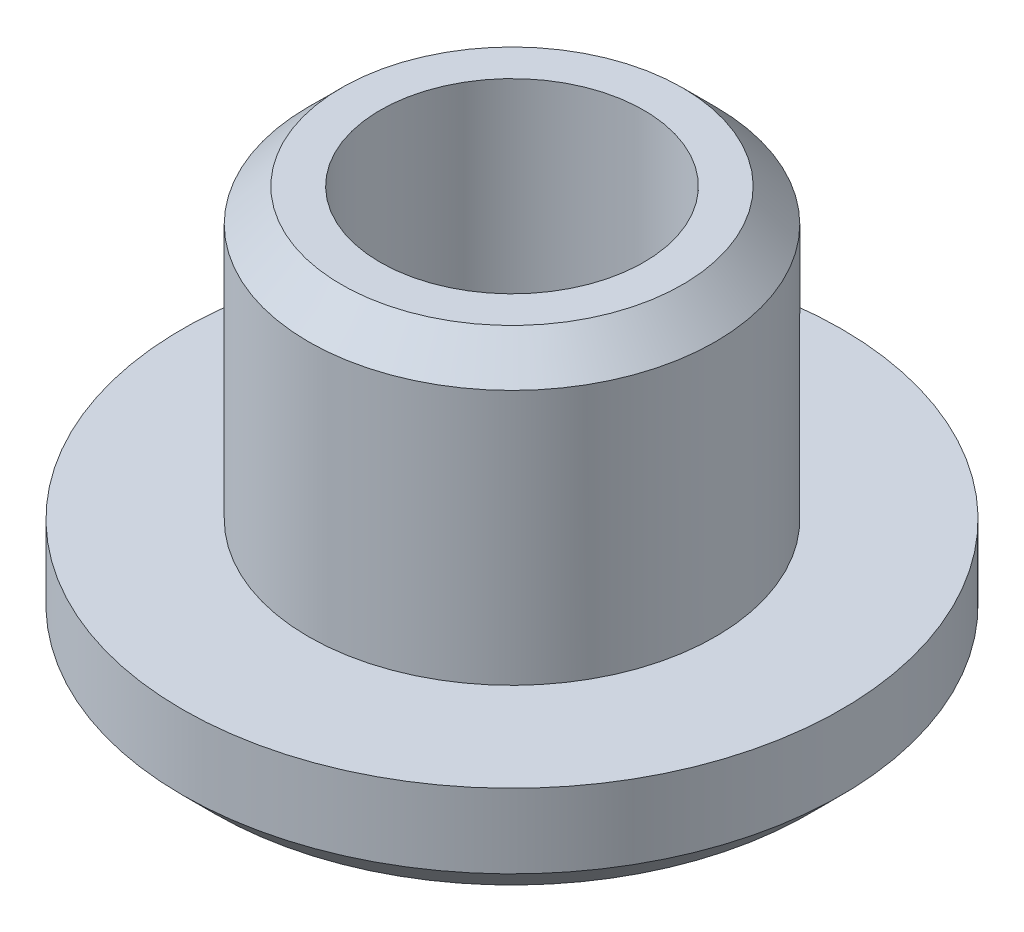
ISO-10303-21;
HEADER;
FILE_DESCRIPTION(('STEP AP214'),'2;1');
FILE_NAME('part.step','',(''),(''),'','','');
FILE_SCHEMA(('AUTOMOTIVE_DESIGN { 1 0 10303 214 1 1 1 1 }'));
ENDSEC;
DATA;
#1=APPLICATION_CONTEXT('core data for automotive mechanical design processes');
#2=APPLICATION_PROTOCOL_DEFINITION('international standard','automotive_design',2000,#1);
#3=PRODUCT_CONTEXT('',#1,'mechanical');
#4=PRODUCT('Part','Part','',(#3));
#5=PRODUCT_RELATED_PRODUCT_CATEGORY('part','',(#4));
#6=PRODUCT_DEFINITION_FORMATION('','',#4);
#7=PRODUCT_DEFINITION_CONTEXT('part definition',#1,'design');
#8=PRODUCT_DEFINITION('design','',#6,#7);
#9=PRODUCT_DEFINITION_SHAPE('','',#8);
#10=(LENGTH_UNIT() NAMED_UNIT(*) SI_UNIT(.MILLI.,.METRE.));
#11=(NAMED_UNIT(*) PLANE_ANGLE_UNIT() SI_UNIT($,.RADIAN.));
#12=(NAMED_UNIT(*) SI_UNIT($,.STERADIAN.) SOLID_ANGLE_UNIT());
#13=UNCERTAINTY_MEASURE_WITH_UNIT(LENGTH_MEASURE(1.E-05),#10,'distance_accuracy_value','');
#14=(GEOMETRIC_REPRESENTATION_CONTEXT(3) GLOBAL_UNCERTAINTY_ASSIGNED_CONTEXT((#13)) GLOBAL_UNIT_ASSIGNED_CONTEXT((#10,
#11,#12)) REPRESENTATION_CONTEXT('',''));
#15=CARTESIAN_POINT('',(0.,0.,0.));
#16=DIRECTION('',(0.,0.,1.));
#17=DIRECTION('',(1.,0.,0.));
#18=AXIS2_PLACEMENT_3D('',#15,#16,#17);
#19=CARTESIAN_POINT('',(0.,4.72147651006711,0.));
#20=DIRECTION('',(0.,1.,0.));
#21=DIRECTION('',(0.,0.,1.));
#22=AXIS2_PLACEMENT_3D('',#19,#20,#21);
#23=CYLINDRICAL_SURFACE('',#22,4.);
#24=CARTESIAN_POINT('',(0.,-0.73193306651043,0.));
#25=DIRECTION('',(0.,1.,0.));
#26=DIRECTION('',(0.,0.,1.));
#27=AXIS2_PLACEMENT_3D('',#24,#25,#26);
#28=CIRCLE('',#27,4.);
#29=CARTESIAN_POINT('',(0.,-0.73193306651043,4.));
#30=VERTEX_POINT('',#29);
#31=EDGE_CURVE('E53',#30,#30,#28,.T.);
#32=ORIENTED_EDGE('',*,*,#31,.T.);
#33=EDGE_LOOP('',(#32));
#34=FACE_BOUND('',#33,.T.);
#35=CARTESIAN_POINT('',(0.,0.16806693348957,0.));
#36=DIRECTION('',(0.,1.,0.));
#37=DIRECTION('',(0.,0.,1.));
#38=AXIS2_PLACEMENT_3D('',#35,#36,#37);
#39=CIRCLE('',#38,4.);
#40=CARTESIAN_POINT('',(0.,0.16806693348957,4.));
#41=VERTEX_POINT('',#40);
#42=EDGE_CURVE('E58',#41,#41,#39,.T.);
#43=ORIENTED_EDGE('',*,*,#42,.F.);
#44=EDGE_LOOP('',(#43));
#45=FACE_BOUND('',#44,.T.);
#46=ADVANCED_FACE('F37',(#34,#45),#23,.T.);
#47=CARTESIAN_POINT('',(4.,0.16806693348957,0.));
#48=DIRECTION('',(0.,-1.,0.));
#49=DIRECTION('',(0.,0.,-1.));
#50=AXIS2_PLACEMENT_3D('',#47,#48,#49);
#51=PLANE('',#50);
#52=CARTESIAN_POINT('',(0.,0.168066933489569,0.));
#53=DIRECTION('',(0.,1.,0.));
#54=DIRECTION('',(0.,0.,1.));
#55=AXIS2_PLACEMENT_3D('',#52,#53,#54);
#56=CIRCLE('',#55,2.47);
#57=CARTESIAN_POINT('',(0.,0.168066933489569,2.47));
#58=VERTEX_POINT('',#57);
#59=EDGE_CURVE('E61',#58,#58,#56,.T.);
#60=ORIENTED_EDGE('',*,*,#59,.F.);
#61=EDGE_LOOP('',(#60));
#62=FACE_BOUND('',#61,.T.);
#63=ORIENTED_EDGE('',*,*,#42,.T.);
#64=EDGE_LOOP('',(#63));
#65=FACE_BOUND('',#64,.T.);
#66=ADVANCED_FACE('F86',(#62,#65),#51,.F.);
#67=CARTESIAN_POINT('',(0.,4.72147651006711,0.));
#68=DIRECTION('',(0.,1.,0.));
#69=DIRECTION('',(0.,0.,1.));
#70=AXIS2_PLACEMENT_3D('',#67,#68,#69);
#71=CYLINDRICAL_SURFACE('',#70,2.47);
#72=CARTESIAN_POINT('',(0.,3.26806693348957,0.));
#73=DIRECTION('',(0.,-1.,0.));
#74=DIRECTION('',(0.,0.,-1.));
#75=AXIS2_PLACEMENT_3D('',#72,#73,#74);
#76=CIRCLE('',#75,2.47);
#77=CARTESIAN_POINT('',(0.,3.26806693348957,-2.47));
#78=VERTEX_POINT('',#77);
#79=EDGE_CURVE('E10',#78,#78,#76,.T.);
#80=ORIENTED_EDGE('',*,*,#79,.T.);
#81=EDGE_LOOP('',(#80));
#82=FACE_BOUND('',#81,.T.);
#83=ORIENTED_EDGE('',*,*,#59,.T.);
#84=EDGE_LOOP('',(#83));
#85=FACE_BOUND('',#84,.T.);
#86=ADVANCED_FACE('F81',(#82,#85),#71,.T.);
#87=CARTESIAN_POINT('',(2.47,3.66806693348957,0.));
#88=DIRECTION('',(0.,-1.,0.));
#89=DIRECTION('',(0.,0.,-1.));
#90=AXIS2_PLACEMENT_3D('',#87,#88,#89);
#91=PLANE('',#90);
#92=CARTESIAN_POINT('',(0.,3.66806693348957,0.));
#93=DIRECTION('',(0.,-1.,0.));
#94=DIRECTION('',(0.,0.,-1.));
#95=AXIS2_PLACEMENT_3D('',#92,#93,#94);
#96=CIRCLE('',#95,2.07);
#97=CARTESIAN_POINT('',(0.,3.66806693348957,-2.07));
#98=VERTEX_POINT('',#97);
#99=EDGE_CURVE('E45',#98,#98,#96,.F.);
#100=ORIENTED_EDGE('',*,*,#99,.T.);
#101=EDGE_LOOP('',(#100));
#102=FACE_BOUND('',#101,.T.);
#103=CARTESIAN_POINT('',(0.,3.66806693348957,0.));
#104=DIRECTION('',(0.,1.,0.));
#105=DIRECTION('',(0.,0.,1.));
#106=AXIS2_PLACEMENT_3D('',#103,#104,#105);
#107=CIRCLE('',#106,1.6);
#108=CARTESIAN_POINT('',(0.,3.66806693348957,1.6));
#109=VERTEX_POINT('',#108);
#110=EDGE_CURVE('E64',#109,#109,#107,.T.);
#111=ORIENTED_EDGE('',*,*,#110,.F.);
#112=EDGE_LOOP('',(#111));
#113=FACE_BOUND('',#112,.T.);
#114=ADVANCED_FACE('F76',(#102,#113),#91,.F.);
#115=CARTESIAN_POINT('',(0.,4.72147651006711,0.));
#116=DIRECTION('',(0.,1.,0.));
#117=DIRECTION('',(0.,0.,1.));
#118=AXIS2_PLACEMENT_3D('',#115,#116,#117);
#119=CYLINDRICAL_SURFACE('',#118,1.6);
#120=CARTESIAN_POINT('',(0.,-1.13193306651043,0.));
#121=DIRECTION('',(0.,1.,0.));
#122=DIRECTION('',(0.,0.,1.));
#123=AXIS2_PLACEMENT_3D('',#120,#121,#122);
#124=CIRCLE('',#123,1.6);
#125=CARTESIAN_POINT('',(0.,-1.13193306651043,1.6));
#126=VERTEX_POINT('',#125);
#127=EDGE_CURVE('E67',#126,#126,#124,.T.);
#128=ORIENTED_EDGE('',*,*,#127,.F.);
#129=EDGE_LOOP('',(#128));
#130=FACE_BOUND('',#129,.T.);
#131=ORIENTED_EDGE('',*,*,#110,.T.);
#132=EDGE_LOOP('',(#131));
#133=FACE_BOUND('',#132,.T.);
#134=ADVANCED_FACE('F73',(#130,#133),#119,.F.);
#135=CARTESIAN_POINT('',(1.6,-1.13193306651043,0.));
#136=DIRECTION('',(0.,1.,0.));
#137=DIRECTION('',(0.,0.,1.));
#138=AXIS2_PLACEMENT_3D('',#135,#136,#137);
#139=PLANE('',#138);
#140=CARTESIAN_POINT('',(0.,-1.13193306651043,0.));
#141=DIRECTION('',(0.,1.,0.));
#142=DIRECTION('',(0.,0.,1.));
#143=AXIS2_PLACEMENT_3D('',#140,#141,#142);
#144=CIRCLE('',#143,3.6);
#145=CARTESIAN_POINT('',(0.,-1.13193306651043,3.6));
#146=VERTEX_POINT('',#145);
#147=EDGE_CURVE('E49',#146,#146,#144,.F.);
#148=ORIENTED_EDGE('',*,*,#147,.T.);
#149=EDGE_LOOP('',(#148));
#150=FACE_BOUND('',#149,.T.);
#151=ORIENTED_EDGE('',*,*,#127,.T.);
#152=EDGE_LOOP('',(#151));
#153=FACE_BOUND('',#152,.T.);
#154=ADVANCED_FACE('F71',(#150,#153),#139,.F.);
#155=CARTESIAN_POINT('',(0.,-0.73193306651043,0.));
#156=DIRECTION('',(0.,1.,0.));
#157=DIRECTION('',(0.,0.,1.));
#158=AXIS2_PLACEMENT_3D('',#155,#156,#157);
#159=CONICAL_SURFACE('',#158,4.,0.785398163397449);
#160=ORIENTED_EDGE('',*,*,#147,.F.);
#161=EDGE_LOOP('',(#160));
#162=FACE_BOUND('',#161,.T.);
#163=ORIENTED_EDGE('',*,*,#31,.F.);
#164=EDGE_LOOP('',(#163));
#165=FACE_BOUND('',#164,.T.);
#166=ADVANCED_FACE('F98',(#162,#165),#159,.T.);
#167=CARTESIAN_POINT('',(0.,3.66806693348957,0.));
#168=DIRECTION('',(0.,-1.,0.));
#169=DIRECTION('',(0.,0.,-1.));
#170=AXIS2_PLACEMENT_3D('',#167,#168,#169);
#171=CONICAL_SURFACE('',#170,2.07,0.785398163397449);
#172=ORIENTED_EDGE('',*,*,#79,.F.);
#173=EDGE_LOOP('',(#172));
#174=FACE_BOUND('',#173,.T.);
#175=ORIENTED_EDGE('',*,*,#99,.F.);
#176=EDGE_LOOP('',(#175));
#177=FACE_BOUND('',#176,.T.);
#178=ADVANCED_FACE('F40',(#174,#177),#171,.T.);
#179=CLOSED_SHELL('',(#46,#66,#86,#114,#134,#154,#166,#178));
#180=MANIFOLD_SOLID_BREP('B2',#179);
#181=ADVANCED_BREP_SHAPE_REPRESENTATION('',(#18,#180),#14);
#182=SHAPE_DEFINITION_REPRESENTATION(#9,#181);
ENDSEC;
END-ISO-10303-21;
